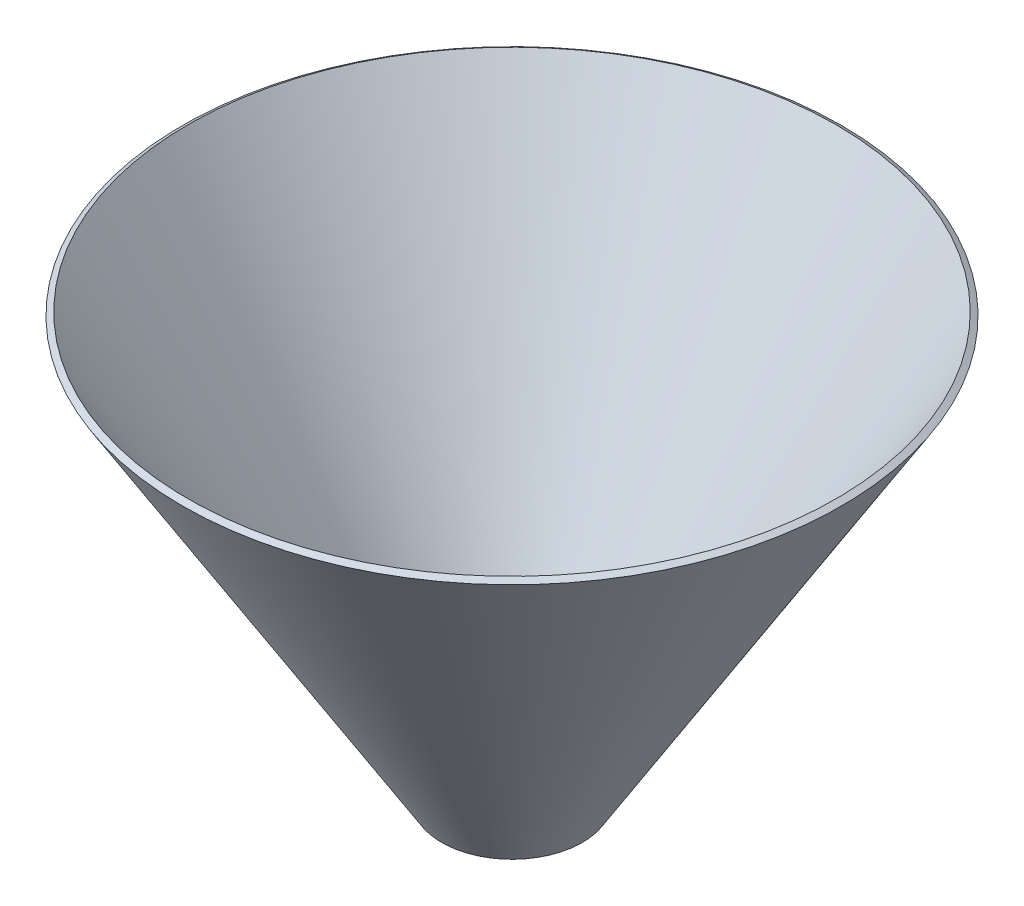
ISO-10303-21;
HEADER;
FILE_DESCRIPTION(('STEP AP214'),'2;1');
FILE_NAME('part.step','',(''),(''),'','','');
FILE_SCHEMA(('AUTOMOTIVE_DESIGN { 1 0 10303 214 1 1 1 1 }'));
ENDSEC;
DATA;
#1=APPLICATION_CONTEXT('core data for automotive mechanical design processes');
#2=APPLICATION_PROTOCOL_DEFINITION('international standard','automotive_design',2000,#1);
#3=PRODUCT_CONTEXT('',#1,'mechanical');
#4=PRODUCT('Part','Part','',(#3));
#5=PRODUCT_RELATED_PRODUCT_CATEGORY('part','',(#4));
#6=PRODUCT_DEFINITION_FORMATION('','',#4);
#7=PRODUCT_DEFINITION_CONTEXT('part definition',#1,'design');
#8=PRODUCT_DEFINITION('design','',#6,#7);
#9=PRODUCT_DEFINITION_SHAPE('','',#8);
#10=(LENGTH_UNIT() NAMED_UNIT(*) SI_UNIT(.MILLI.,.METRE.));
#11=(NAMED_UNIT(*) PLANE_ANGLE_UNIT() SI_UNIT($,.RADIAN.));
#12=(NAMED_UNIT(*) SI_UNIT($,.STERADIAN.) SOLID_ANGLE_UNIT());
#13=UNCERTAINTY_MEASURE_WITH_UNIT(LENGTH_MEASURE(1.E-05),#10,'distance_accuracy_value','');
#14=(GEOMETRIC_REPRESENTATION_CONTEXT(3) GLOBAL_UNCERTAINTY_ASSIGNED_CONTEXT((#13)) GLOBAL_UNIT_ASSIGNED_CONTEXT((#10,
#11,#12)) REPRESENTATION_CONTEXT('',''));
#15=CARTESIAN_POINT('',(0.,0.,0.));
#16=DIRECTION('',(0.,0.,1.));
#17=DIRECTION('',(1.,0.,0.));
#18=AXIS2_PLACEMENT_3D('',#15,#16,#17);
#19=CARTESIAN_POINT('',(0.,-0.524243441701798,0.));
#20=DIRECTION('',(0.,1.,0.));
#21=DIRECTION('',(0.,0.,1.));
#22=AXIS2_PLACEMENT_3D('',#19,#20,#21);
#23=CONICAL_SURFACE('',#22,10.8515684434223,0.551826440657932);
#24=CARTESIAN_POINT('',(0.,64.4507949227593,0.));
#25=DIRECTION('',(0.,-1.,0.));
#26=DIRECTION('',(0.,0.,-1.));
#27=AXIS2_PLACEMENT_3D('',#24,#25,#26);
#28=CIRCLE('',#27,50.8515684434223);
#29=CARTESIAN_POINT('',(0.,64.4507949227593,-50.8515684434223));
#30=VERTEX_POINT('',#29);
#31=EDGE_CURVE('E45',#30,#30,#28,.T.);
#32=ORIENTED_EDGE('',*,*,#31,.T.);
#33=EDGE_LOOP('',(#32));
#34=FACE_BOUND('',#33,.T.);
#35=CARTESIAN_POINT('',(0.,-0.524243441701798,0.));
#36=DIRECTION('',(0.,-1.,0.));
#37=DIRECTION('',(0.,0.,-1.));
#38=AXIS2_PLACEMENT_3D('',#35,#36,#37);
#39=CIRCLE('',#38,10.8515684434223);
#40=CARTESIAN_POINT('',(0.,-0.524243441701798,-10.8515684434223));
#41=VERTEX_POINT('',#40);
#42=EDGE_CURVE('E10',#41,#41,#39,.T.);
#43=ORIENTED_EDGE('',*,*,#42,.F.);
#44=EDGE_LOOP('',(#43));
#45=FACE_BOUND('',#44,.T.);
#46=ADVANCED_FACE('F31',(#34,#45),#23,.T.);
#47=CARTESIAN_POINT('',(0.,-0.524243441701798,0.));
#48=DIRECTION('',(0.,-1.,0.));
#49=DIRECTION('',(0.,0.,-1.));
#50=AXIS2_PLACEMENT_3D('',#47,#48,#49);
#51=CONICAL_SURFACE('',#50,10.8515684434223,1.01896988613696);
#52=CARTESIAN_POINT('',(0.,0.,0.));
#53=DIRECTION('',(0.,-1.,0.));
#54=DIRECTION('',(0.,0.,-1.));
#55=AXIS2_PLACEMENT_3D('',#52,#53,#54);
#56=CIRCLE('',#55,10.);
#57=CARTESIAN_POINT('',(0.,0.,-10.));
#58=VERTEX_POINT('',#57);
#59=EDGE_CURVE('E37',#58,#58,#56,.T.);
#60=ORIENTED_EDGE('',*,*,#59,.F.);
#61=EDGE_LOOP('',(#60));
#62=FACE_BOUND('',#61,.T.);
#63=ORIENTED_EDGE('',*,*,#42,.T.);
#64=EDGE_LOOP('',(#63));
#65=FACE_BOUND('',#64,.T.);
#66=ADVANCED_FACE('F61',(#62,#65),#51,.F.);
#67=CARTESIAN_POINT('',(0.,0.,0.));
#68=DIRECTION('',(0.,1.,0.));
#69=DIRECTION('',(0.,0.,1.));
#70=AXIS2_PLACEMENT_3D('',#67,#68,#69);
#71=CONICAL_SURFACE('',#70,10.,0.551826440657932);
#72=CARTESIAN_POINT('',(0.,64.9750383644611,0.));
#73=DIRECTION('',(0.,-1.,0.));
#74=DIRECTION('',(0.,0.,-1.));
#75=AXIS2_PLACEMENT_3D('',#72,#73,#74);
#76=CIRCLE('',#75,50.);
#77=CARTESIAN_POINT('',(0.,64.9750383644611,-50.));
#78=VERTEX_POINT('',#77);
#79=EDGE_CURVE('E41',#78,#78,#76,.T.);
#80=ORIENTED_EDGE('',*,*,#79,.F.);
#81=EDGE_LOOP('',(#80));
#82=FACE_BOUND('',#81,.T.);
#83=ORIENTED_EDGE('',*,*,#59,.T.);
#84=EDGE_LOOP('',(#83));
#85=FACE_BOUND('',#84,.T.);
#86=ADVANCED_FACE('F56',(#82,#85),#71,.F.);
#87=CARTESIAN_POINT('',(0.,64.9750383644611,0.));
#88=DIRECTION('',(0.,-1.,0.));
#89=DIRECTION('',(0.,0.,-1.));
#90=AXIS2_PLACEMENT_3D('',#87,#88,#89);
#91=CONICAL_SURFACE('',#90,50.,1.01896988613698);
#92=ORIENTED_EDGE('',*,*,#31,.F.);
#93=EDGE_LOOP('',(#92));
#94=FACE_BOUND('',#93,.T.);
#95=ORIENTED_EDGE('',*,*,#79,.T.);
#96=EDGE_LOOP('',(#95));
#97=FACE_BOUND('',#96,.T.);
#98=ADVANCED_FACE('F53',(#94,#97),#91,.T.);
#99=CLOSED_SHELL('',(#46,#66,#86,#98));
#100=MANIFOLD_SOLID_BREP('B2',#99);
#101=ADVANCED_BREP_SHAPE_REPRESENTATION('',(#18,#100),#14);
#102=SHAPE_DEFINITION_REPRESENTATION(#9,#101);
ENDSEC;
END-ISO-10303-21;
